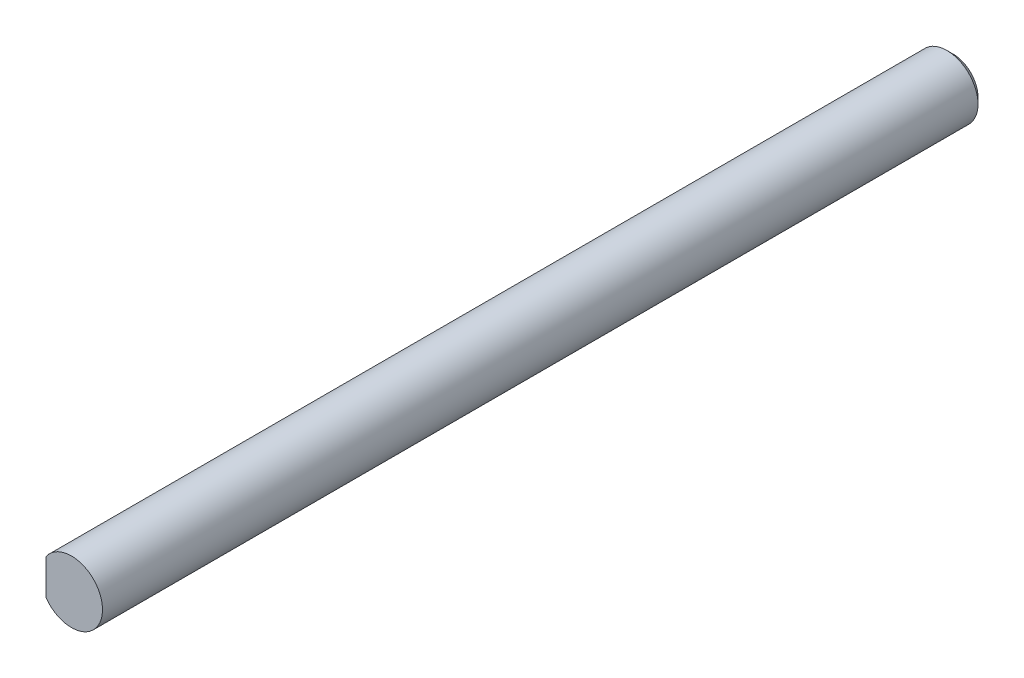
ISO-10303-21;
HEADER;
FILE_DESCRIPTION(('STEP AP214'),'2;1');
FILE_NAME('part.step','',(''),(''),'','','');
FILE_SCHEMA(('AUTOMOTIVE_DESIGN { 1 0 10303 214 1 1 1 1 }'));
ENDSEC;
DATA;
#1=APPLICATION_CONTEXT('core data for automotive mechanical design processes');
#2=APPLICATION_PROTOCOL_DEFINITION('international standard','automotive_design',2000,#1);
#3=PRODUCT_CONTEXT('',#1,'mechanical');
#4=PRODUCT('Part','Part','',(#3));
#5=PRODUCT_RELATED_PRODUCT_CATEGORY('part','',(#4));
#6=PRODUCT_DEFINITION_FORMATION('','',#4);
#7=PRODUCT_DEFINITION_CONTEXT('part definition',#1,'design');
#8=PRODUCT_DEFINITION('design','',#6,#7);
#9=PRODUCT_DEFINITION_SHAPE('','',#8);
#10=(LENGTH_UNIT() NAMED_UNIT(*) SI_UNIT(.MILLI.,.METRE.));
#11=(NAMED_UNIT(*) PLANE_ANGLE_UNIT() SI_UNIT($,.RADIAN.));
#12=(NAMED_UNIT(*) SI_UNIT($,.STERADIAN.) SOLID_ANGLE_UNIT());
#13=UNCERTAINTY_MEASURE_WITH_UNIT(LENGTH_MEASURE(1.E-05),#10,'distance_accuracy_value','');
#14=(GEOMETRIC_REPRESENTATION_CONTEXT(3) GLOBAL_UNCERTAINTY_ASSIGNED_CONTEXT((#13)) GLOBAL_UNIT_ASSIGNED_CONTEXT((#10,
#11,#12)) REPRESENTATION_CONTEXT('',''));
#15=CARTESIAN_POINT('',(0.,0.,0.));
#16=DIRECTION('',(0.,0.,1.));
#17=DIRECTION('',(1.,0.,0.));
#18=AXIS2_PLACEMENT_3D('',#15,#16,#17);
#19=CARTESIAN_POINT('',(0.,0.,71.));
#20=DIRECTION('',(0.,0.,-1.));
#21=DIRECTION('',(-1.,0.,0.));
#22=AXIS2_PLACEMENT_3D('',#19,#20,#21);
#23=CYLINDRICAL_SURFACE('',#22,2.5);
#24=CARTESIAN_POINT('',(0.,0.,0.499999999999987));
#25=DIRECTION('',(0.,0.,1.));
#26=DIRECTION('',(1.,0.,0.));
#27=AXIS2_PLACEMENT_3D('',#24,#25,#26);
#28=CIRCLE('',#27,2.5);
#29=CARTESIAN_POINT('',(2.5,0.,0.499999999999987));
#30=VERTEX_POINT('',#29);
#31=EDGE_CURVE('E45',#30,#30,#28,.T.);
#32=ORIENTED_EDGE('',*,*,#31,.T.);
#33=EDGE_LOOP('',(#32));
#34=FACE_BOUND('',#33,.T.);
#35=CARTESIAN_POINT('',(0.,0.,71.));
#36=DIRECTION('',(0.,0.,1.));
#37=DIRECTION('',(1.,0.,0.));
#38=AXIS2_PLACEMENT_3D('',#35,#36,#37);
#39=CIRCLE('',#38,2.5);
#40=CARTESIAN_POINT('',(-2.05,-1.43090880212542,71.));
#41=VERTEX_POINT('',#40);
#42=CARTESIAN_POINT('',(-2.05,1.43090880212542,71.));
#43=VERTEX_POINT('',#42);
#44=EDGE_CURVE('E72',#41,#43,#39,.T.);
#45=ORIENTED_EDGE('',*,*,#44,.F.);
#46=DIRECTION('',(0.,0.,1.));
#47=VECTOR('',#46,1.);
#48=CARTESIAN_POINT('',(-2.05,-1.43090880212542,57.));
#49=LINE('',#48,#47);
#50=CARTESIAN_POINT('',(-2.05,-1.43090880212542,57.));
#51=VERTEX_POINT('',#50);
#52=EDGE_CURVE('E52',#51,#41,#49,.T.);
#53=ORIENTED_EDGE('',*,*,#52,.F.);
#54=CARTESIAN_POINT('',(0.,0.,57.));
#55=DIRECTION('',(0.,0.,1.));
#56=DIRECTION('',(1.,0.,0.));
#57=AXIS2_PLACEMENT_3D('',#54,#55,#56);
#58=CIRCLE('',#57,2.5);
#59=CARTESIAN_POINT('',(-2.05,1.43090880212542,57.));
#60=VERTEX_POINT('',#59);
#61=EDGE_CURVE('E68',#60,#51,#58,.T.);
#62=ORIENTED_EDGE('',*,*,#61,.F.);
#63=DIRECTION('',(0.,0.,1.));
#64=VECTOR('',#63,1.);
#65=CARTESIAN_POINT('',(-2.05,1.43090880212542,57.));
#66=LINE('',#65,#64);
#67=EDGE_CURVE('E58',#60,#43,#66,.T.);
#68=ORIENTED_EDGE('',*,*,#67,.T.);
#69=EDGE_LOOP('',(#45,#53,#62,#68));
#70=FACE_BOUND('',#69,.T.);
#71=ADVANCED_FACE('F36',(#34,#70),#23,.T.);
#72=CARTESIAN_POINT('',(0.,0.,71.));
#73=DIRECTION('',(0.,0.,1.));
#74=DIRECTION('',(1.,0.,0.));
#75=AXIS2_PLACEMENT_3D('',#72,#73,#74);
#76=PLANE('',#75);
#77=DIRECTION('',(0.,1.,0.));
#78=VECTOR('',#77,1.);
#79=CARTESIAN_POINT('',(-2.05,1.43090880212542,71.));
#80=LINE('',#79,#78);
#81=EDGE_CURVE('E63',#41,#43,#80,.T.);
#82=ORIENTED_EDGE('',*,*,#81,.F.);
#83=ORIENTED_EDGE('',*,*,#44,.T.);
#84=EDGE_LOOP('',(#82,#83));
#85=FACE_BOUND('',#84,.T.);
#86=ADVANCED_FACE('F74',(#85),#76,.T.);
#87=CARTESIAN_POINT('',(0.,0.,0.));
#88=DIRECTION('',(0.,0.,1.));
#89=DIRECTION('',(1.,0.,0.));
#90=AXIS2_PLACEMENT_3D('',#87,#88,#89);
#91=PLANE('',#90);
#92=CARTESIAN_POINT('',(0.,0.,0.));
#93=DIRECTION('',(0.,0.,1.));
#94=DIRECTION('',(1.,0.,0.));
#95=AXIS2_PLACEMENT_3D('',#92,#93,#94);
#96=CIRCLE('',#95,2.00000000000001);
#97=CARTESIAN_POINT('',(2.00000000000001,0.,0.));
#98=VERTEX_POINT('',#97);
#99=EDGE_CURVE('E11',#98,#98,#96,.F.);
#100=ORIENTED_EDGE('',*,*,#99,.T.);
#101=EDGE_LOOP('',(#100));
#102=FACE_BOUND('',#101,.T.);
#103=ADVANCED_FACE('F90',(#102),#91,.F.);
#104=CARTESIAN_POINT('',(-2.05,1.43090880212542,57.));
#105=DIRECTION('',(1.,0.,0.));
#106=DIRECTION('',(0.,0.,-1.));
#107=AXIS2_PLACEMENT_3D('',#104,#105,#106);
#108=PLANE('',#107);
#109=ORIENTED_EDGE('',*,*,#81,.T.);
#110=ORIENTED_EDGE('',*,*,#67,.F.);
#111=DIRECTION('',(0.,1.,0.));
#112=VECTOR('',#111,1.);
#113=CARTESIAN_POINT('',(-2.05,1.43090880212542,57.));
#114=LINE('',#113,#112);
#115=EDGE_CURVE('E78',#51,#60,#114,.T.);
#116=ORIENTED_EDGE('',*,*,#115,.F.);
#117=ORIENTED_EDGE('',*,*,#52,.T.);
#118=EDGE_LOOP('',(#109,#110,#116,#117));
#119=FACE_BOUND('',#118,.T.);
#120=ADVANCED_FACE('F64',(#119),#108,.F.);
#121=CARTESIAN_POINT('',(0.,0.,57.));
#122=DIRECTION('',(0.,0.,1.));
#123=DIRECTION('',(1.,0.,0.));
#124=AXIS2_PLACEMENT_3D('',#121,#122,#123);
#125=PLANE('',#124);
#126=ORIENTED_EDGE('',*,*,#61,.T.);
#127=ORIENTED_EDGE('',*,*,#115,.T.);
#128=EDGE_LOOP('',(#126,#127));
#129=FACE_BOUND('',#128,.T.);
#130=ADVANCED_FACE('F82',(#129),#125,.T.);
#131=CARTESIAN_POINT('',(0.,0.,0.499999999999987));
#132=DIRECTION('',(0.,0.,1.));
#133=DIRECTION('',(1.,0.,0.));
#134=AXIS2_PLACEMENT_3D('',#131,#132,#133);
#135=CONICAL_SURFACE('',#134,2.5,0.785398163397454);
#136=ORIENTED_EDGE('',*,*,#99,.F.);
#137=EDGE_LOOP('',(#136));
#138=FACE_BOUND('',#137,.T.);
#139=ORIENTED_EDGE('',*,*,#31,.F.);
#140=EDGE_LOOP('',(#139));
#141=FACE_BOUND('',#140,.T.);
#142=ADVANCED_FACE('F39',(#138,#141),#135,.T.);
#143=CLOSED_SHELL('',(#71,#86,#103,#120,#130,#142));
#144=MANIFOLD_SOLID_BREP('B2',#143);
#145=ADVANCED_BREP_SHAPE_REPRESENTATION('',(#18,#144),#14);
#146=SHAPE_DEFINITION_REPRESENTATION(#9,#145);
ENDSEC;
END-ISO-10303-21;
